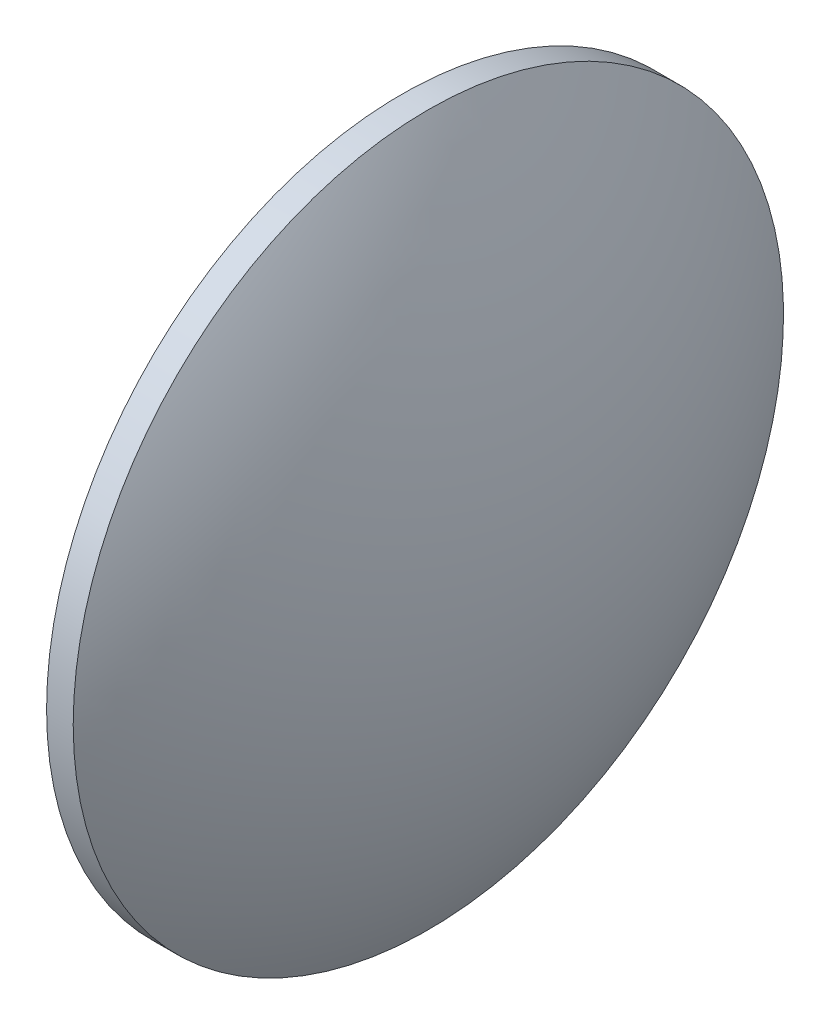
ISO-10303-21;
HEADER;
FILE_DESCRIPTION(('STEP AP214'),'2;1');
FILE_NAME('part.step','',(''),(''),'','','');
FILE_SCHEMA(('AUTOMOTIVE_DESIGN { 1 0 10303 214 1 1 1 1 }'));
ENDSEC;
DATA;
#1=APPLICATION_CONTEXT('core data for automotive mechanical design processes');
#2=APPLICATION_PROTOCOL_DEFINITION('international standard','automotive_design',2000,#1);
#3=PRODUCT_CONTEXT('',#1,'mechanical');
#4=PRODUCT('Part','Part','',(#3));
#5=PRODUCT_RELATED_PRODUCT_CATEGORY('part','',(#4));
#6=PRODUCT_DEFINITION_FORMATION('','',#4);
#7=PRODUCT_DEFINITION_CONTEXT('part definition',#1,'design');
#8=PRODUCT_DEFINITION('design','',#6,#7);
#9=PRODUCT_DEFINITION_SHAPE('','',#8);
#10=(LENGTH_UNIT() NAMED_UNIT(*) SI_UNIT(.MILLI.,.METRE.));
#11=(NAMED_UNIT(*) PLANE_ANGLE_UNIT() SI_UNIT($,.RADIAN.));
#12=(NAMED_UNIT(*) SI_UNIT($,.STERADIAN.) SOLID_ANGLE_UNIT());
#13=UNCERTAINTY_MEASURE_WITH_UNIT(LENGTH_MEASURE(1.E-05),#10,'distance_accuracy_value','');
#14=(GEOMETRIC_REPRESENTATION_CONTEXT(3) GLOBAL_UNCERTAINTY_ASSIGNED_CONTEXT((#13)) GLOBAL_UNIT_ASSIGNED_CONTEXT((#10,
#11,#12)) REPRESENTATION_CONTEXT('',''));
#15=CARTESIAN_POINT('',(0.,0.,0.));
#16=DIRECTION('',(0.,0.,1.));
#17=DIRECTION('',(1.,0.,0.));
#18=AXIS2_PLACEMENT_3D('',#15,#16,#17);
#19=CARTESIAN_POINT('',(162.566648180855,130.467109852824,0.));
#20=DIRECTION('',(-1.,0.,0.));
#21=DIRECTION('',(0.,1.,0.));
#22=AXIS2_PLACEMENT_3D('',#19,#20,#21);
#23=SPHERICAL_SURFACE('',#22,77.5024460431654);
#24=CARTESIAN_POINT('',(228.949094224021,130.467109852824,0.));
#25=DIRECTION('',(-1.,0.,0.));
#26=DIRECTION('',(0.,0.,1.));
#27=AXIS2_PLACEMENT_3D('',#24,#25,#26);
#28=CIRCLE('',#27,40.);
#29=CARTESIAN_POINT('',(228.949094224021,130.467109852824,40.));
#30=VERTEX_POINT('',#29);
#31=EDGE_CURVE('E10',#30,#30,#28,.T.);
#32=ORIENTED_EDGE('',*,*,#31,.F.);
#33=EDGE_LOOP('',(#32));
#34=FACE_BOUND('',#33,.T.);
#35=ADVANCED_FACE('F35',(#34),#23,.T.);
#36=CARTESIAN_POINT('',(217.994582532387,130.467109852824,0.));
#37=DIRECTION('',(-1.,0.,0.));
#38=DIRECTION('',(0.,0.,1.));
#39=AXIS2_PLACEMENT_3D('',#36,#37,#38);
#40=CYLINDRICAL_SURFACE('',#39,40.);
#41=CARTESIAN_POINT('',(225.949094224021,130.467109852824,0.));
#42=DIRECTION('',(-1.,0.,0.));
#43=DIRECTION('',(0.,0.,1.));
#44=AXIS2_PLACEMENT_3D('',#41,#42,#43);
#45=CIRCLE('',#44,40.);
#46=CARTESIAN_POINT('',(225.949094224021,130.467109852824,40.));
#47=VERTEX_POINT('',#46);
#48=EDGE_CURVE('E41',#47,#47,#45,.T.);
#49=ORIENTED_EDGE('',*,*,#48,.F.);
#50=EDGE_LOOP('',(#49));
#51=FACE_BOUND('',#50,.T.);
#52=ORIENTED_EDGE('',*,*,#31,.T.);
#53=EDGE_LOOP('',(#52));
#54=FACE_BOUND('',#53,.T.);
#55=ADVANCED_FACE('F49',(#51,#54),#40,.T.);
#56=CARTESIAN_POINT('',(225.949094224021,130.467109852824,0.));
#57=DIRECTION('',(1.,0.,0.));
#58=DIRECTION('',(0.,0.,-1.));
#59=AXIS2_PLACEMENT_3D('',#56,#57,#58);
#60=PLANE('',#59);
#61=ORIENTED_EDGE('',*,*,#48,.T.);
#62=EDGE_LOOP('',(#61));
#63=FACE_BOUND('',#62,.T.);
#64=ADVANCED_FACE('F47',(#63),#60,.F.);
#65=CLOSED_SHELL('',(#35,#55,#64));
#66=MANIFOLD_SOLID_BREP('B2',#65);
#67=ADVANCED_BREP_SHAPE_REPRESENTATION('',(#18,#66),#14);
#68=SHAPE_DEFINITION_REPRESENTATION(#9,#67);
ENDSEC;
END-ISO-10303-21;
